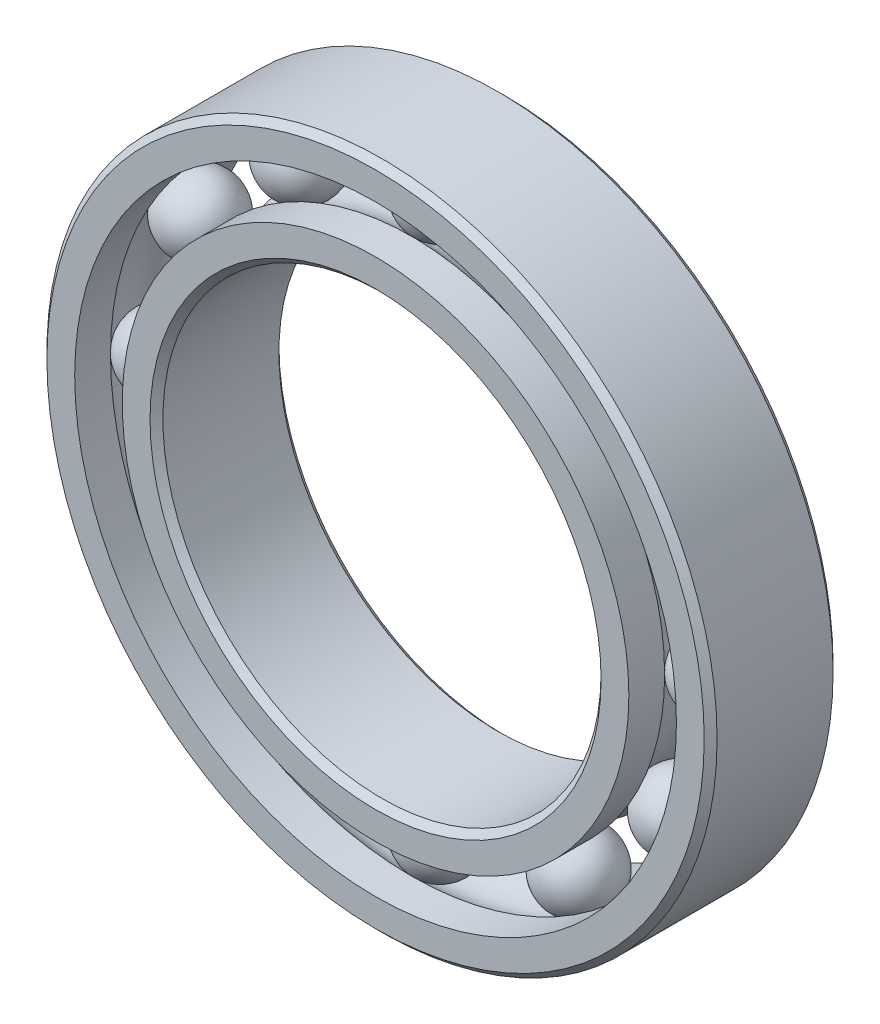
ISO-10303-21;
HEADER;
FILE_DESCRIPTION(('STEP AP214'),'2;1');
FILE_NAME('part.step','',(''),(''),'','','');
FILE_SCHEMA(('AUTOMOTIVE_DESIGN { 1 0 10303 214 1 1 1 1 }'));
ENDSEC;
DATA;
#1=APPLICATION_CONTEXT('core data for automotive mechanical design processes');
#2=APPLICATION_PROTOCOL_DEFINITION('international standard','automotive_design',2000,#1);
#3=PRODUCT_CONTEXT('',#1,'mechanical');
#4=PRODUCT('Part','Part','',(#3));
#5=PRODUCT_RELATED_PRODUCT_CATEGORY('part','',(#4));
#6=PRODUCT_DEFINITION_FORMATION('','',#4);
#7=PRODUCT_DEFINITION_CONTEXT('part definition',#1,'design');
#8=PRODUCT_DEFINITION('design','',#6,#7);
#9=PRODUCT_DEFINITION_SHAPE('','',#8);
#10=(LENGTH_UNIT() NAMED_UNIT(*) SI_UNIT(.MILLI.,.METRE.));
#11=(NAMED_UNIT(*) PLANE_ANGLE_UNIT() SI_UNIT($,.RADIAN.));
#12=(NAMED_UNIT(*) SI_UNIT($,.STERADIAN.) SOLID_ANGLE_UNIT());
#13=UNCERTAINTY_MEASURE_WITH_UNIT(LENGTH_MEASURE(1.E-05),#10,'distance_accuracy_value','');
#14=(GEOMETRIC_REPRESENTATION_CONTEXT(3) GLOBAL_UNCERTAINTY_ASSIGNED_CONTEXT((#13)) GLOBAL_UNIT_ASSIGNED_CONTEXT((#10,
#11,#12)) REPRESENTATION_CONTEXT('',''));
#15=CARTESIAN_POINT('',(0.,0.,0.));
#16=DIRECTION('',(0.,0.,1.));
#17=DIRECTION('',(1.,0.,0.));
#18=AXIS2_PLACEMENT_3D('',#15,#16,#17);
#19=CARTESIAN_POINT('',(-5.37499999999988,9.30977309068278,0.));
#20=DIRECTION('',(0.,0.,1.));
#21=DIRECTION('',(-0.499999999999989,0.866025403784445,0.));
#22=AXIS2_PLACEMENT_3D('',#19,#20,#21);
#23=SPHERICAL_SURFACE('',#22,1.44452030347507);
#24=CARTESIAN_POINT('',(-5.37499999999988,9.30977309068278,1.44452030347507));
#25=VERTEX_POINT('',#24);
#26=VERTEX_LOOP('',#25);
#27=FACE_BOUND('',#26,.T.);
#28=ADVANCED_FACE('F38',(#27),#23,.T.);
#29=CLOSED_SHELL('',(#28));
#30=MANIFOLD_SOLID_BREP('B2',#29);
#31=CARTESIAN_POINT('',(-9.30977309068265,5.37500000000011,0.));
#32=DIRECTION('',(0.,0.,1.));
#33=DIRECTION('',(-0.866025403784433,0.50000000000001,0.));
#34=AXIS2_PLACEMENT_3D('',#31,#32,#33);
#35=SPHERICAL_SURFACE('',#34,1.44452030347507);
#36=CARTESIAN_POINT('',(-9.30977309068265,5.37500000000011,1.44452030347507));
#37=VERTEX_POINT('',#36);
#38=VERTEX_LOOP('',#37);
#39=FACE_BOUND('',#38,.T.);
#40=ADVANCED_FACE('F59',(#39),#35,.T.);
#41=CLOSED_SHELL('',(#40));
#42=MANIFOLD_SOLID_BREP('B6',#41);
#43=CARTESIAN_POINT('',(-10.75,1.12600273177691E-13,0.));
#44=DIRECTION('',(0.,0.,1.));
#45=DIRECTION('',(-1.,0.,0.));
#46=AXIS2_PLACEMENT_3D('',#43,#44,#45);
#47=SPHERICAL_SURFACE('',#46,1.44452030347507);
#48=CARTESIAN_POINT('',(-10.75,1.12600273177691E-13,1.44452030347507));
#49=VERTEX_POINT('',#48);
#50=VERTEX_LOOP('',#49);
#51=FACE_BOUND('',#50,.T.);
#52=ADVANCED_FACE('F80',(#51),#47,.T.);
#53=CLOSED_SHELL('',(#52));
#54=MANIFOLD_SOLID_BREP('B34',#53);
#55=CARTESIAN_POINT('',(-9.30977309068276,-5.37499999999991,0.));
#56=DIRECTION('',(0.,0.,1.));
#57=DIRECTION('',(-0.866025403784443,-0.499999999999992,0.));
#58=AXIS2_PLACEMENT_3D('',#55,#56,#57);
#59=SPHERICAL_SURFACE('',#58,1.44452030347507);
#60=CARTESIAN_POINT('',(-9.30977309068276,-5.37499999999991,1.44452030347507));
#61=VERTEX_POINT('',#60);
#62=VERTEX_LOOP('',#61);
#63=FACE_BOUND('',#62,.T.);
#64=ADVANCED_FACE('F101',(#63),#59,.T.);
#65=CLOSED_SHELL('',(#64));
#66=MANIFOLD_SOLID_BREP('B55',#65);
#67=CARTESIAN_POINT('',(-5.37500000000008,-9.30977309068267,0.));
#68=DIRECTION('',(0.,0.,1.));
#69=DIRECTION('',(-0.500000000000007,-0.866025403784435,0.));
#70=AXIS2_PLACEMENT_3D('',#67,#68,#69);
#71=SPHERICAL_SURFACE('',#70,1.44452030347507);
#72=CARTESIAN_POINT('',(-5.37500000000008,-9.30977309068267,1.44452030347507));
#73=VERTEX_POINT('',#72);
#74=VERTEX_LOOP('',#73);
#75=FACE_BOUND('',#74,.T.);
#76=ADVANCED_FACE('F122',(#75),#71,.T.);
#77=CLOSED_SHELL('',(#76));
#78=MANIFOLD_SOLID_BREP('B76',#77);
#79=CARTESIAN_POINT('',(0.,-10.75,0.));
#80=DIRECTION('',(0.,0.,1.));
#81=DIRECTION('',(0.,-1.,0.));
#82=AXIS2_PLACEMENT_3D('',#79,#80,#81);
#83=SPHERICAL_SURFACE('',#82,1.44452030347507);
#84=CARTESIAN_POINT('',(0.,-10.75,1.44452030347507));
#85=VERTEX_POINT('',#84);
#86=VERTEX_LOOP('',#85);
#87=FACE_BOUND('',#86,.T.);
#88=ADVANCED_FACE('F143',(#87),#83,.T.);
#89=CLOSED_SHELL('',(#88));
#90=MANIFOLD_SOLID_BREP('B97',#89);
#91=CARTESIAN_POINT('',(5.37499999999994,-9.30977309068275,0.));
#92=DIRECTION('',(0.,0.,1.));
#93=DIRECTION('',(0.499999999999995,-0.866025403784442,0.));
#94=AXIS2_PLACEMENT_3D('',#91,#92,#93);
#95=SPHERICAL_SURFACE('',#94,1.44452030347507);
#96=CARTESIAN_POINT('',(5.37499999999994,-9.30977309068275,1.44452030347507));
#97=VERTEX_POINT('',#96);
#98=VERTEX_LOOP('',#97);
#99=FACE_BOUND('',#98,.T.);
#100=ADVANCED_FACE('F164',(#99),#95,.T.);
#101=CLOSED_SHELL('',(#100));
#102=MANIFOLD_SOLID_BREP('B118',#101);
#103=CARTESIAN_POINT('',(9.30977309068269,-5.37500000000004,0.));
#104=DIRECTION('',(0.,0.,1.));
#105=DIRECTION('',(0.866025403784436,-0.500000000000004,0.));
#106=AXIS2_PLACEMENT_3D('',#103,#104,#105);
#107=SPHERICAL_SURFACE('',#106,1.44452030347507);
#108=CARTESIAN_POINT('',(9.30977309068269,-5.37500000000004,1.44452030347507));
#109=VERTEX_POINT('',#108);
#110=VERTEX_LOOP('',#109);
#111=FACE_BOUND('',#110,.T.);
#112=ADVANCED_FACE('F185',(#111),#107,.T.);
#113=CLOSED_SHELL('',(#112));
#114=MANIFOLD_SOLID_BREP('B139',#113);
#115=CARTESIAN_POINT('',(10.75,0.,0.));
#116=DIRECTION('',(0.,0.,1.));
#117=DIRECTION('',(1.,0.,0.));
#118=AXIS2_PLACEMENT_3D('',#115,#116,#117);
#119=SPHERICAL_SURFACE('',#118,1.44452030347507);
#120=CARTESIAN_POINT('',(10.75,0.,1.44452030347507));
#121=VERTEX_POINT('',#120);
#122=VERTEX_LOOP('',#121);
#123=FACE_BOUND('',#122,.T.);
#124=ADVANCED_FACE('F206',(#123),#119,.T.);
#125=CLOSED_SHELL('',(#124));
#126=MANIFOLD_SOLID_BREP('B160',#125);
#127=CARTESIAN_POINT('',(9.30977309068273,5.37499999999998,0.));
#128=DIRECTION('',(0.,0.,1.));
#129=DIRECTION('',(0.86602540378444,0.499999999999998,0.));
#130=AXIS2_PLACEMENT_3D('',#127,#128,#129);
#131=SPHERICAL_SURFACE('',#130,1.44452030347507);
#132=CARTESIAN_POINT('',(9.30977309068273,5.37499999999998,1.44452030347507));
#133=VERTEX_POINT('',#132);
#134=VERTEX_LOOP('',#133);
#135=FACE_BOUND('',#134,.T.);
#136=ADVANCED_FACE('F227',(#135),#131,.T.);
#137=CLOSED_SHELL('',(#136));
#138=MANIFOLD_SOLID_BREP('B181',#137);
#139=CARTESIAN_POINT('',(5.37500000000001,9.30977309068271,0.));
#140=DIRECTION('',(0.,0.,1.));
#141=DIRECTION('',(0.500000000000001,0.866025403784438,0.));
#142=AXIS2_PLACEMENT_3D('',#139,#140,#141);
#143=SPHERICAL_SURFACE('',#142,1.44452030347507);
#144=CARTESIAN_POINT('',(5.37500000000001,9.30977309068271,1.44452030347507));
#145=VERTEX_POINT('',#144);
#146=VERTEX_LOOP('',#145);
#147=FACE_BOUND('',#146,.T.);
#148=ADVANCED_FACE('F248',(#147),#143,.T.);
#149=CLOSED_SHELL('',(#148));
#150=MANIFOLD_SOLID_BREP('B202',#149);
#151=CARTESIAN_POINT('',(0.,10.75,0.));
#152=DIRECTION('',(0.,0.,1.));
#153=DIRECTION('',(0.,1.,0.));
#154=AXIS2_PLACEMENT_3D('',#151,#152,#153);
#155=SPHERICAL_SURFACE('',#154,1.44452030347507);
#156=CARTESIAN_POINT('',(0.,10.75,1.44452030347507));
#157=VERTEX_POINT('',#156);
#158=VERTEX_LOOP('',#157);
#159=FACE_BOUND('',#158,.T.);
#160=ADVANCED_FACE('F271',(#159),#155,.T.);
#161=CLOSED_SHELL('',(#160));
#162=MANIFOLD_SOLID_BREP('B223',#161);
#163=CARTESIAN_POINT('',(0.,9.82692307692308,2.50000000000001));
#164=DIRECTION('',(0.,0.,-1.));
#165=DIRECTION('',(-1.,0.,0.));
#166=AXIS2_PLACEMENT_3D('',#163,#164,#165);
#167=PLANE('',#166);
#168=CARTESIAN_POINT('',(0.,0.,2.5));
#169=DIRECTION('',(0.,0.,1.));
#170=DIRECTION('',(1.,0.,0.));
#171=AXIS2_PLACEMENT_3D('',#168,#169,#170);
#172=CIRCLE('',#171,8.75);
#173=CARTESIAN_POINT('',(8.75,0.,2.5));
#174=VERTEX_POINT('',#173);
#175=EDGE_CURVE('E319',#174,#174,#172,.T.);
#176=ORIENTED_EDGE('',*,*,#175,.F.);
#177=EDGE_LOOP('',(#176));
#178=FACE_BOUND('',#177,.T.);
#179=CARTESIAN_POINT('',(0.,0.,2.50000000000001));
#180=DIRECTION('',(0.,0.,1.));
#181=DIRECTION('',(1.,0.,0.));
#182=AXIS2_PLACEMENT_3D('',#179,#180,#181);
#183=CIRCLE('',#182,9.82692307692308);
#184=CARTESIAN_POINT('',(9.82692307692308,0.,2.50000000000001));
#185=VERTEX_POINT('',#184);
#186=EDGE_CURVE('E270',#185,#185,#183,.T.);
#187=ORIENTED_EDGE('',*,*,#186,.T.);
#188=EDGE_LOOP('',(#187));
#189=FACE_BOUND('',#188,.T.);
#190=ADVANCED_FACE('F291',(#178,#189),#167,.F.);
#191=CARTESIAN_POINT('',(0.,0.,2.5));
#192=DIRECTION('',(0.,0.,1.));
#193=DIRECTION('',(1.,0.,0.));
#194=AXIS2_PLACEMENT_3D('',#191,#192,#193);
#195=CYLINDRICAL_SURFACE('',#194,9.82692307692308);
#196=ORIENTED_EDGE('',*,*,#186,.F.);
#197=EDGE_LOOP('',(#196));
#198=FACE_BOUND('',#197,.T.);
#199=CARTESIAN_POINT('',(0.,0.,1.11111111111111));
#200=DIRECTION('',(0.,0.,1.));
#201=DIRECTION('',(1.,0.,0.));
#202=AXIS2_PLACEMENT_3D('',#199,#200,#201);
#203=CIRCLE('',#202,9.82692307692308);
#204=CARTESIAN_POINT('',(9.82692307692308,0.,1.11111111111111));
#205=VERTEX_POINT('',#204);
#206=EDGE_CURVE('E297',#205,#205,#203,.T.);
#207=ORIENTED_EDGE('',*,*,#206,.T.);
#208=EDGE_LOOP('',(#207));
#209=FACE_BOUND('',#208,.T.);
#210=ADVANCED_FACE('F326',(#198,#209),#195,.T.);
#211=CARTESIAN_POINT('',(0.,0.,0.));
#212=DIRECTION('',(0.,0.,1.));
#213=DIRECTION('',(1.,0.,0.));
#214=AXIS2_PLACEMENT_3D('',#211,#212,#213);
#215=TOROIDAL_SURFACE('',#214,10.75,1.44452030347507);
#216=ORIENTED_EDGE('',*,*,#206,.F.);
#217=EDGE_LOOP('',(#216));
#218=FACE_BOUND('',#217,.T.);
#219=CARTESIAN_POINT('',(0.,0.,-1.11111111111111));
#220=DIRECTION('',(0.,0.,1.));
#221=DIRECTION('',(1.,0.,0.));
#222=AXIS2_PLACEMENT_3D('',#219,#220,#221);
#223=CIRCLE('',#222,9.82692307692308);
#224=CARTESIAN_POINT('',(9.82692307692308,0.,-1.11111111111111));
#225=VERTEX_POINT('',#224);
#226=EDGE_CURVE('E301',#225,#225,#223,.T.);
#227=ORIENTED_EDGE('',*,*,#226,.T.);
#228=EDGE_LOOP('',(#227));
#229=FACE_BOUND('',#228,.T.);
#230=ADVANCED_FACE('F330',(#218,#229),#215,.F.);
#231=CARTESIAN_POINT('',(0.,0.,2.5));
#232=DIRECTION('',(0.,0.,1.));
#233=DIRECTION('',(1.,0.,0.));
#234=AXIS2_PLACEMENT_3D('',#231,#232,#233);
#235=CYLINDRICAL_SURFACE('',#234,9.82692307692308);
#236=ORIENTED_EDGE('',*,*,#226,.F.);
#237=EDGE_LOOP('',(#236));
#238=FACE_BOUND('',#237,.T.);
#239=CARTESIAN_POINT('',(0.,0.,-2.50000000000001));
#240=DIRECTION('',(0.,0.,1.));
#241=DIRECTION('',(1.,0.,0.));
#242=AXIS2_PLACEMENT_3D('',#239,#240,#241);
#243=CIRCLE('',#242,9.82692307692308);
#244=CARTESIAN_POINT('',(9.82692307692308,0.,-2.50000000000001));
#245=VERTEX_POINT('',#244);
#246=EDGE_CURVE('E305',#245,#245,#243,.T.);
#247=ORIENTED_EDGE('',*,*,#246,.T.);
#248=EDGE_LOOP('',(#247));
#249=FACE_BOUND('',#248,.T.);
#250=ADVANCED_FACE('F335',(#238,#249),#235,.T.);
#251=CARTESIAN_POINT('',(0.,8.75,-2.50000000000001));
#252=DIRECTION('',(0.,0.,1.));
#253=DIRECTION('',(1.,0.,0.));
#254=AXIS2_PLACEMENT_3D('',#251,#252,#253);
#255=PLANE('',#254);
#256=ORIENTED_EDGE('',*,*,#246,.F.);
#257=EDGE_LOOP('',(#256));
#258=FACE_BOUND('',#257,.T.);
#259=CARTESIAN_POINT('',(0.,0.,-2.50000000000001));
#260=DIRECTION('',(0.,0.,1.));
#261=DIRECTION('',(1.,0.,0.));
#262=AXIS2_PLACEMENT_3D('',#259,#260,#261);
#263=CIRCLE('',#262,8.75);
#264=CARTESIAN_POINT('',(8.75,0.,-2.50000000000001));
#265=VERTEX_POINT('',#264);
#266=EDGE_CURVE('E310',#265,#265,#263,.T.);
#267=ORIENTED_EDGE('',*,*,#266,.T.);
#268=EDGE_LOOP('',(#267));
#269=FACE_BOUND('',#268,.T.);
#270=ADVANCED_FACE('F341',(#258,#269),#255,.F.);
#271=CARTESIAN_POINT('',(0.,0.,-2.25000000000001));
#272=DIRECTION('',(0.,0.,-1.));
#273=DIRECTION('',(-1.,0.,0.));
#274=AXIS2_PLACEMENT_3D('',#271,#272,#273);
#275=CONICAL_SURFACE('',#274,8.5,0.785398163397448);
#276=ORIENTED_EDGE('',*,*,#266,.F.);
#277=EDGE_LOOP('',(#276));
#278=FACE_BOUND('',#277,.T.);
#279=CARTESIAN_POINT('',(0.,0.,-2.25000000000001));
#280=DIRECTION('',(0.,0.,1.));
#281=DIRECTION('',(1.,0.,0.));
#282=AXIS2_PLACEMENT_3D('',#279,#280,#281);
#283=CIRCLE('',#282,8.5);
#284=CARTESIAN_POINT('',(8.5,0.,-2.25000000000001));
#285=VERTEX_POINT('',#284);
#286=EDGE_CURVE('E313',#285,#285,#283,.T.);
#287=ORIENTED_EDGE('',*,*,#286,.T.);
#288=EDGE_LOOP('',(#287));
#289=FACE_BOUND('',#288,.T.);
#290=ADVANCED_FACE('F345',(#278,#289),#275,.F.);
#291=CARTESIAN_POINT('',(0.,0.,2.5));
#292=DIRECTION('',(0.,0.,1.));
#293=DIRECTION('',(1.,0.,0.));
#294=AXIS2_PLACEMENT_3D('',#291,#292,#293);
#295=CYLINDRICAL_SURFACE('',#294,8.5);
#296=ORIENTED_EDGE('',*,*,#286,.F.);
#297=EDGE_LOOP('',(#296));
#298=FACE_BOUND('',#297,.T.);
#299=CARTESIAN_POINT('',(0.,0.,2.25000000000001));
#300=DIRECTION('',(0.,0.,1.));
#301=DIRECTION('',(1.,0.,0.));
#302=AXIS2_PLACEMENT_3D('',#299,#300,#301);
#303=CIRCLE('',#302,8.5);
#304=CARTESIAN_POINT('',(8.5,0.,2.25000000000001));
#305=VERTEX_POINT('',#304);
#306=EDGE_CURVE('E316',#305,#305,#303,.T.);
#307=ORIENTED_EDGE('',*,*,#306,.T.);
#308=EDGE_LOOP('',(#307));
#309=FACE_BOUND('',#308,.T.);
#310=ADVANCED_FACE('F349',(#298,#309),#295,.F.);
#311=CARTESIAN_POINT('',(0.,0.,2.5));
#312=DIRECTION('',(0.,0.,1.));
#313=DIRECTION('',(1.,0.,0.));
#314=AXIS2_PLACEMENT_3D('',#311,#312,#313);
#315=CONICAL_SURFACE('',#314,8.75,0.785398163397453);
#316=ORIENTED_EDGE('',*,*,#306,.F.);
#317=EDGE_LOOP('',(#316));
#318=FACE_BOUND('',#317,.T.);
#319=ORIENTED_EDGE('',*,*,#175,.T.);
#320=EDGE_LOOP('',(#319));
#321=FACE_BOUND('',#320,.T.);
#322=ADVANCED_FACE('F323',(#318,#321),#315,.F.);
#323=CLOSED_SHELL('',(#190,#210,#230,#250,#270,#290,#310,#322));
#324=MANIFOLD_SOLID_BREP('B244',#323);
#325=CARTESIAN_POINT('',(0.,0.,2.25));
#326=DIRECTION('',(0.,0.,-1.));
#327=DIRECTION('',(-1.,0.,0.));
#328=AXIS2_PLACEMENT_3D('',#325,#326,#327);
#329=CONICAL_SURFACE('',#328,13.,0.785398163397448);
#330=CARTESIAN_POINT('',(0.,0.,2.5));
#331=DIRECTION('',(0.,0.,1.));
#332=DIRECTION('',(1.,0.,0.));
#333=AXIS2_PLACEMENT_3D('',#330,#331,#332);
#334=CIRCLE('',#333,12.75);
#335=CARTESIAN_POINT('',(12.75,0.,2.5));
#336=VERTEX_POINT('',#335);
#337=EDGE_CURVE('E441',#336,#336,#334,.T.);
#338=ORIENTED_EDGE('',*,*,#337,.F.);
#339=EDGE_LOOP('',(#338));
#340=FACE_BOUND('',#339,.T.);
#341=CARTESIAN_POINT('',(0.,0.,2.25));
#342=DIRECTION('',(0.,0.,1.));
#343=DIRECTION('',(1.,0.,0.));
#344=AXIS2_PLACEMENT_3D('',#341,#342,#343);
#345=CIRCLE('',#344,13.);
#346=CARTESIAN_POINT('',(13.,0.,2.25));
#347=VERTEX_POINT('',#346);
#348=EDGE_CURVE('E290',#347,#347,#345,.T.);
#349=ORIENTED_EDGE('',*,*,#348,.T.);
#350=EDGE_LOOP('',(#349));
#351=FACE_BOUND('',#350,.T.);
#352=ADVANCED_FACE('F413',(#340,#351),#329,.T.);
#353=CARTESIAN_POINT('',(0.,0.,2.5));
#354=DIRECTION('',(0.,0.,1.));
#355=DIRECTION('',(1.,0.,0.));
#356=AXIS2_PLACEMENT_3D('',#353,#354,#355);
#357=CYLINDRICAL_SURFACE('',#356,13.);
#358=ORIENTED_EDGE('',*,*,#348,.F.);
#359=EDGE_LOOP('',(#358));
#360=FACE_BOUND('',#359,.T.);
#361=CARTESIAN_POINT('',(0.,0.,-2.25000000000001));
#362=DIRECTION('',(0.,0.,1.));
#363=DIRECTION('',(1.,0.,0.));
#364=AXIS2_PLACEMENT_3D('',#361,#362,#363);
#365=CIRCLE('',#364,13.);
#366=CARTESIAN_POINT('',(13.,0.,-2.25000000000001));
#367=VERTEX_POINT('',#366);
#368=EDGE_CURVE('E419',#367,#367,#365,.T.);
#369=ORIENTED_EDGE('',*,*,#368,.T.);
#370=EDGE_LOOP('',(#369));
#371=FACE_BOUND('',#370,.T.);
#372=ADVANCED_FACE('F448',(#360,#371),#357,.T.);
#373=CARTESIAN_POINT('',(0.,0.,-2.50000000000001));
#374=DIRECTION('',(0.,0.,1.));
#375=DIRECTION('',(1.,0.,0.));
#376=AXIS2_PLACEMENT_3D('',#373,#374,#375);
#377=CONICAL_SURFACE('',#376,12.75,0.785398163397448);
#378=ORIENTED_EDGE('',*,*,#368,.F.);
#379=EDGE_LOOP('',(#378));
#380=FACE_BOUND('',#379,.T.);
#381=CARTESIAN_POINT('',(0.,0.,-2.50000000000001));
#382=DIRECTION('',(0.,0.,1.));
#383=DIRECTION('',(1.,0.,0.));
#384=AXIS2_PLACEMENT_3D('',#381,#382,#383);
#385=CIRCLE('',#384,12.75);
#386=CARTESIAN_POINT('',(12.75,0.,-2.50000000000001));
#387=VERTEX_POINT('',#386);
#388=EDGE_CURVE('E423',#387,#387,#385,.T.);
#389=ORIENTED_EDGE('',*,*,#388,.T.);
#390=EDGE_LOOP('',(#389));
#391=FACE_BOUND('',#390,.T.);
#392=ADVANCED_FACE('F452',(#380,#391),#377,.T.);
#393=CARTESIAN_POINT('',(0.,12.75,-2.50000000000001));
#394=DIRECTION('',(0.,0.,1.));
#395=DIRECTION('',(1.,0.,0.));
#396=AXIS2_PLACEMENT_3D('',#393,#394,#395);
#397=PLANE('',#396);
#398=ORIENTED_EDGE('',*,*,#388,.F.);
#399=EDGE_LOOP('',(#398));
#400=FACE_BOUND('',#399,.T.);
#401=CARTESIAN_POINT('',(0.,0.,-2.50000000000001));
#402=DIRECTION('',(0.,0.,1.));
#403=DIRECTION('',(1.,0.,0.));
#404=AXIS2_PLACEMENT_3D('',#401,#402,#403);
#405=CIRCLE('',#404,11.6730769230769);
#406=CARTESIAN_POINT('',(11.6730769230769,0.,-2.50000000000001));
#407=VERTEX_POINT('',#406);
#408=EDGE_CURVE('E427',#407,#407,#405,.T.);
#409=ORIENTED_EDGE('',*,*,#408,.T.);
#410=EDGE_LOOP('',(#409));
#411=FACE_BOUND('',#410,.T.);
#412=ADVANCED_FACE('F457',(#400,#411),#397,.F.);
#413=CARTESIAN_POINT('',(0.,0.,2.5));
#414=DIRECTION('',(0.,0.,1.));
#415=DIRECTION('',(1.,0.,0.));
#416=AXIS2_PLACEMENT_3D('',#413,#414,#415);
#417=CYLINDRICAL_SURFACE('',#416,11.6730769230769);
#418=ORIENTED_EDGE('',*,*,#408,.F.);
#419=EDGE_LOOP('',(#418));
#420=FACE_BOUND('',#419,.T.);
#421=CARTESIAN_POINT('',(0.,0.,-1.11111111111111));
#422=DIRECTION('',(0.,0.,1.));
#423=DIRECTION('',(1.,0.,0.));
#424=AXIS2_PLACEMENT_3D('',#421,#422,#423);
#425=CIRCLE('',#424,11.6730769230769);
#426=CARTESIAN_POINT('',(11.6730769230769,0.,-1.11111111111111));
#427=VERTEX_POINT('',#426);
#428=EDGE_CURVE('E432',#427,#427,#425,.T.);
#429=ORIENTED_EDGE('',*,*,#428,.T.);
#430=EDGE_LOOP('',(#429));
#431=FACE_BOUND('',#430,.T.);
#432=ADVANCED_FACE('F463',(#420,#431),#417,.F.);
#433=CARTESIAN_POINT('',(0.,0.,0.));
#434=DIRECTION('',(0.,0.,1.));
#435=DIRECTION('',(1.,0.,0.));
#436=AXIS2_PLACEMENT_3D('',#433,#434,#435);
#437=TOROIDAL_SURFACE('',#436,10.75,1.44452030347507);
#438=ORIENTED_EDGE('',*,*,#428,.F.);
#439=EDGE_LOOP('',(#438));
#440=FACE_BOUND('',#439,.T.);
#441=CARTESIAN_POINT('',(0.,0.,1.11111111111111));
#442=DIRECTION('',(0.,0.,1.));
#443=DIRECTION('',(1.,0.,0.));
#444=AXIS2_PLACEMENT_3D('',#441,#442,#443);
#445=CIRCLE('',#444,11.6730769230769);
#446=CARTESIAN_POINT('',(11.6730769230769,0.,1.11111111111111));
#447=VERTEX_POINT('',#446);
#448=EDGE_CURVE('E435',#447,#447,#445,.T.);
#449=ORIENTED_EDGE('',*,*,#448,.T.);
#450=EDGE_LOOP('',(#449));
#451=FACE_BOUND('',#450,.T.);
#452=ADVANCED_FACE('F467',(#440,#451),#437,.F.);
#453=CARTESIAN_POINT('',(0.,0.,2.5));
#454=DIRECTION('',(0.,0.,1.));
#455=DIRECTION('',(1.,0.,0.));
#456=AXIS2_PLACEMENT_3D('',#453,#454,#455);
#457=CYLINDRICAL_SURFACE('',#456,11.6730769230769);
#458=ORIENTED_EDGE('',*,*,#448,.F.);
#459=EDGE_LOOP('',(#458));
#460=FACE_BOUND('',#459,.T.);
#461=CARTESIAN_POINT('',(0.,0.,2.5));
#462=DIRECTION('',(0.,0.,1.));
#463=DIRECTION('',(1.,0.,0.));
#464=AXIS2_PLACEMENT_3D('',#461,#462,#463);
#465=CIRCLE('',#464,11.6730769230769);
#466=CARTESIAN_POINT('',(11.6730769230769,0.,2.5));
#467=VERTEX_POINT('',#466);
#468=EDGE_CURVE('E438',#467,#467,#465,.T.);
#469=ORIENTED_EDGE('',*,*,#468,.T.);
#470=EDGE_LOOP('',(#469));
#471=FACE_BOUND('',#470,.T.);
#472=ADVANCED_FACE('F471',(#460,#471),#457,.F.);
#473=CARTESIAN_POINT('',(0.,12.75,2.5));
#474=DIRECTION('',(0.,0.,-1.));
#475=DIRECTION('',(-1.,0.,0.));
#476=AXIS2_PLACEMENT_3D('',#473,#474,#475);
#477=PLANE('',#476);
#478=ORIENTED_EDGE('',*,*,#468,.F.);
#479=EDGE_LOOP('',(#478));
#480=FACE_BOUND('',#479,.T.);
#481=ORIENTED_EDGE('',*,*,#337,.T.);
#482=EDGE_LOOP('',(#481));
#483=FACE_BOUND('',#482,.T.);
#484=ADVANCED_FACE('F445',(#480,#483),#477,.F.);
#485=CLOSED_SHELL('',(#352,#372,#392,#412,#432,#452,#472,#484));
#486=MANIFOLD_SOLID_BREP('B265',#485);
#487=ADVANCED_BREP_SHAPE_REPRESENTATION('',(#18,#30,#42,#54,#66,#78,#90,#102,#114,#126,#138,
#150,#162,#324,#486),#14);
#488=SHAPE_DEFINITION_REPRESENTATION(#9,#487);
ENDSEC;
END-ISO-10303-21;
